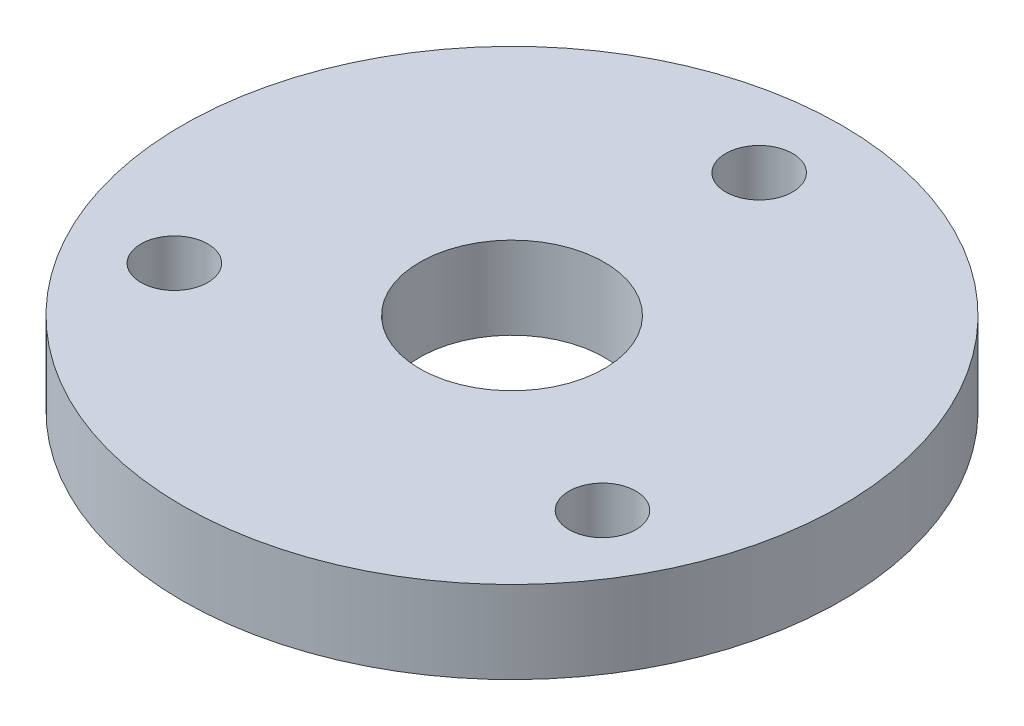
ISO-10303-21;
HEADER;
FILE_DESCRIPTION(('STEP AP214'),'2;1');
FILE_NAME('part.step','',(''),(''),'','','');
FILE_SCHEMA(('AUTOMOTIVE_DESIGN { 1 0 10303 214 1 1 1 1 }'));
ENDSEC;
DATA;
#1=APPLICATION_CONTEXT('core data for automotive mechanical design processes');
#2=APPLICATION_PROTOCOL_DEFINITION('international standard','automotive_design',2000,#1);
#3=PRODUCT_CONTEXT('',#1,'mechanical');
#4=PRODUCT('Part','Part','',(#3));
#5=PRODUCT_RELATED_PRODUCT_CATEGORY('part','',(#4));
#6=PRODUCT_DEFINITION_FORMATION('','',#4);
#7=PRODUCT_DEFINITION_CONTEXT('part definition',#1,'design');
#8=PRODUCT_DEFINITION('design','',#6,#7);
#9=PRODUCT_DEFINITION_SHAPE('','',#8);
#10=(LENGTH_UNIT() NAMED_UNIT(*) SI_UNIT(.MILLI.,.METRE.));
#11=(NAMED_UNIT(*) PLANE_ANGLE_UNIT() SI_UNIT($,.RADIAN.));
#12=(NAMED_UNIT(*) SI_UNIT($,.STERADIAN.) SOLID_ANGLE_UNIT());
#13=UNCERTAINTY_MEASURE_WITH_UNIT(LENGTH_MEASURE(1.E-05),#10,'distance_accuracy_value','');
#14=(GEOMETRIC_REPRESENTATION_CONTEXT(3) GLOBAL_UNCERTAINTY_ASSIGNED_CONTEXT((#13)) GLOBAL_UNIT_ASSIGNED_CONTEXT((#10,
#11,#12)) REPRESENTATION_CONTEXT('',''));
#15=CARTESIAN_POINT('',(0.,0.,0.));
#16=DIRECTION('',(0.,0.,1.));
#17=DIRECTION('',(1.,0.,0.));
#18=AXIS2_PLACEMENT_3D('',#15,#16,#17);
#19=CARTESIAN_POINT('',(0.,12.5,0.));
#20=DIRECTION('',(0.,1.,0.));
#21=DIRECTION('',(0.,0.,1.));
#22=AXIS2_PLACEMENT_3D('',#19,#20,#21);
#23=PLANE('',#22);
#24=CARTESIAN_POINT('',(64.9519052838316,12.5,37.4999999999968));
#25=DIRECTION('',(0.,1.,0.));
#26=DIRECTION('',(0.,0.,1.));
#27=AXIS2_PLACEMENT_3D('',#24,#25,#26);
#28=CIRCLE('',#27,10.1500000000032);
#29=CARTESIAN_POINT('',(64.9519052838316,12.5,47.65));
#30=VERTEX_POINT('',#29);
#31=EDGE_CURVE('E53',#30,#30,#28,.T.);
#32=ORIENTED_EDGE('',*,*,#31,.F.);
#33=EDGE_LOOP('',(#32));
#34=FACE_BOUND('',#33,.T.);
#35=CARTESIAN_POINT('',(0.,12.5,0.));
#36=DIRECTION('',(0.,1.,0.));
#37=DIRECTION('',(0.,0.,1.));
#38=AXIS2_PLACEMENT_3D('',#35,#36,#37);
#39=CIRCLE('',#38,28.);
#40=CARTESIAN_POINT('',(0.,12.5,28.));
#41=VERTEX_POINT('',#40);
#42=EDGE_CURVE('E42',#41,#41,#39,.T.);
#43=ORIENTED_EDGE('',*,*,#42,.F.);
#44=EDGE_LOOP('',(#43));
#45=FACE_BOUND('',#44,.T.);
#46=CARTESIAN_POINT('',(0.,12.5,0.));
#47=DIRECTION('',(0.,1.,0.));
#48=DIRECTION('',(0.,0.,1.));
#49=AXIS2_PLACEMENT_3D('',#46,#47,#48);
#50=CIRCLE('',#49,100.);
#51=CARTESIAN_POINT('',(0.,12.5,100.));
#52=VERTEX_POINT('',#51);
#53=EDGE_CURVE('E10',#52,#52,#50,.T.);
#54=ORIENTED_EDGE('',*,*,#53,.T.);
#55=EDGE_LOOP('',(#54));
#56=FACE_BOUND('',#55,.T.);
#57=CARTESIAN_POINT('',(0.,12.5,-75.));
#58=DIRECTION('',(0.,1.,0.));
#59=DIRECTION('',(0.,0.,1.));
#60=AXIS2_PLACEMENT_3D('',#57,#58,#59);
#61=CIRCLE('',#60,10.15);
#62=CARTESIAN_POINT('',(0.,12.5,-64.85));
#63=VERTEX_POINT('',#62);
#64=EDGE_CURVE('E47',#63,#63,#61,.T.);
#65=ORIENTED_EDGE('',*,*,#64,.F.);
#66=EDGE_LOOP('',(#65));
#67=FACE_BOUND('',#66,.T.);
#68=CARTESIAN_POINT('',(-64.9519052838308,12.5,37.4999999999973));
#69=DIRECTION('',(0.,1.,0.));
#70=DIRECTION('',(0.,0.,1.));
#71=AXIS2_PLACEMENT_3D('',#68,#69,#70);
#72=CIRCLE('',#71,10.1500000000004);
#73=CARTESIAN_POINT('',(-64.9519052838308,12.5,47.6499999999977));
#74=VERTEX_POINT('',#73);
#75=EDGE_CURVE('E59',#74,#74,#72,.T.);
#76=ORIENTED_EDGE('',*,*,#75,.F.);
#77=EDGE_LOOP('',(#76));
#78=FACE_BOUND('',#77,.T.);
#79=ADVANCED_FACE('F31',(#34,#45,#56,#67,#78),#23,.T.);
#80=CARTESIAN_POINT('',(0.,-12.5,0.));
#81=DIRECTION('',(0.,1.,0.));
#82=DIRECTION('',(0.,0.,1.));
#83=AXIS2_PLACEMENT_3D('',#80,#81,#82);
#84=PLANE('',#83);
#85=CARTESIAN_POINT('',(0.,-12.5,0.));
#86=DIRECTION('',(0.,1.,0.));
#87=DIRECTION('',(0.,0.,1.));
#88=AXIS2_PLACEMENT_3D('',#85,#86,#87);
#89=CIRCLE('',#88,100.);
#90=CARTESIAN_POINT('',(0.,-12.5,100.));
#91=VERTEX_POINT('',#90);
#92=EDGE_CURVE('E35',#91,#91,#89,.T.);
#93=ORIENTED_EDGE('',*,*,#92,.F.);
#94=EDGE_LOOP('',(#93));
#95=FACE_BOUND('',#94,.T.);
#96=CARTESIAN_POINT('',(0.,-12.5,0.));
#97=DIRECTION('',(0.,1.,0.));
#98=DIRECTION('',(0.,0.,1.));
#99=AXIS2_PLACEMENT_3D('',#96,#97,#98);
#100=CIRCLE('',#99,28.);
#101=CARTESIAN_POINT('',(0.,-12.5,28.));
#102=VERTEX_POINT('',#101);
#103=EDGE_CURVE('E44',#102,#102,#100,.T.);
#104=ORIENTED_EDGE('',*,*,#103,.T.);
#105=EDGE_LOOP('',(#104));
#106=FACE_BOUND('',#105,.T.);
#107=CARTESIAN_POINT('',(0.,-12.5,-75.));
#108=DIRECTION('',(0.,1.,0.));
#109=DIRECTION('',(0.,0.,1.));
#110=AXIS2_PLACEMENT_3D('',#107,#108,#109);
#111=CIRCLE('',#110,10.15);
#112=CARTESIAN_POINT('',(0.,-12.5,-64.85));
#113=VERTEX_POINT('',#112);
#114=EDGE_CURVE('E50',#113,#113,#111,.T.);
#115=ORIENTED_EDGE('',*,*,#114,.T.);
#116=EDGE_LOOP('',(#115));
#117=FACE_BOUND('',#116,.T.);
#118=CARTESIAN_POINT('',(64.9519052838316,-12.5,37.4999999999968));
#119=DIRECTION('',(0.,1.,0.));
#120=DIRECTION('',(0.,0.,1.));
#121=AXIS2_PLACEMENT_3D('',#118,#119,#120);
#122=CIRCLE('',#121,10.1500000000032);
#123=CARTESIAN_POINT('',(64.9519052838316,-12.5,47.65));
#124=VERTEX_POINT('',#123);
#125=EDGE_CURVE('E56',#124,#124,#122,.T.);
#126=ORIENTED_EDGE('',*,*,#125,.T.);
#127=EDGE_LOOP('',(#126));
#128=FACE_BOUND('',#127,.T.);
#129=CARTESIAN_POINT('',(-64.9519052838308,-12.5,37.4999999999973));
#130=DIRECTION('',(0.,1.,0.));
#131=DIRECTION('',(0.,0.,1.));
#132=AXIS2_PLACEMENT_3D('',#129,#130,#131);
#133=CIRCLE('',#132,10.1500000000004);
#134=CARTESIAN_POINT('',(-64.9519052838308,-12.5,47.6499999999977));
#135=VERTEX_POINT('',#134);
#136=EDGE_CURVE('E62',#135,#135,#133,.T.);
#137=ORIENTED_EDGE('',*,*,#136,.T.);
#138=EDGE_LOOP('',(#137));
#139=FACE_BOUND('',#138,.T.);
#140=ADVANCED_FACE('F72',(#95,#106,#117,#128,#139),#84,.F.);
#141=CARTESIAN_POINT('',(0.,12.5,0.));
#142=DIRECTION('',(0.,-1.,0.));
#143=DIRECTION('',(0.,0.,-1.));
#144=AXIS2_PLACEMENT_3D('',#141,#142,#143);
#145=CYLINDRICAL_SURFACE('',#144,100.);
#146=ORIENTED_EDGE('',*,*,#53,.F.);
#147=EDGE_LOOP('',(#146));
#148=FACE_BOUND('',#147,.T.);
#149=ORIENTED_EDGE('',*,*,#92,.T.);
#150=EDGE_LOOP('',(#149));
#151=FACE_BOUND('',#150,.T.);
#152=ADVANCED_FACE('F33',(#148,#151),#145,.T.);
#153=CARTESIAN_POINT('',(0.,12.5,0.));
#154=DIRECTION('',(0.,-1.,0.));
#155=DIRECTION('',(0.,0.,-1.));
#156=AXIS2_PLACEMENT_3D('',#153,#154,#155);
#157=CYLINDRICAL_SURFACE('',#156,28.);
#158=ORIENTED_EDGE('',*,*,#42,.T.);
#159=EDGE_LOOP('',(#158));
#160=FACE_BOUND('',#159,.T.);
#161=ORIENTED_EDGE('',*,*,#103,.F.);
#162=EDGE_LOOP('',(#161));
#163=FACE_BOUND('',#162,.T.);
#164=ADVANCED_FACE('F82',(#160,#163),#157,.F.);
#165=CARTESIAN_POINT('',(0.,12.5,-75.));
#166=DIRECTION('',(0.,-1.,0.));
#167=DIRECTION('',(0.,0.,-1.));
#168=AXIS2_PLACEMENT_3D('',#165,#166,#167);
#169=CYLINDRICAL_SURFACE('',#168,10.15);
#170=ORIENTED_EDGE('',*,*,#64,.T.);
#171=EDGE_LOOP('',(#170));
#172=FACE_BOUND('',#171,.T.);
#173=ORIENTED_EDGE('',*,*,#114,.F.);
#174=EDGE_LOOP('',(#173));
#175=FACE_BOUND('',#174,.T.);
#176=ADVANCED_FACE('F85',(#172,#175),#169,.F.);
#177=CARTESIAN_POINT('',(64.9519052838316,12.5,37.4999999999968));
#178=DIRECTION('',(0.,-1.,0.));
#179=DIRECTION('',(0.,0.,-1.));
#180=AXIS2_PLACEMENT_3D('',#177,#178,#179);
#181=CYLINDRICAL_SURFACE('',#180,10.1500000000032);
#182=ORIENTED_EDGE('',*,*,#31,.T.);
#183=EDGE_LOOP('',(#182));
#184=FACE_BOUND('',#183,.T.);
#185=ORIENTED_EDGE('',*,*,#125,.F.);
#186=EDGE_LOOP('',(#185));
#187=FACE_BOUND('',#186,.T.);
#188=ADVANCED_FACE('F89',(#184,#187),#181,.F.);
#189=CARTESIAN_POINT('',(-64.9519052838308,12.5,37.4999999999973));
#190=DIRECTION('',(0.,-1.,0.));
#191=DIRECTION('',(0.,0.,-1.));
#192=AXIS2_PLACEMENT_3D('',#189,#190,#191);
#193=CYLINDRICAL_SURFACE('',#192,10.1500000000004);
#194=ORIENTED_EDGE('',*,*,#75,.T.);
#195=EDGE_LOOP('',(#194));
#196=FACE_BOUND('',#195,.T.);
#197=ORIENTED_EDGE('',*,*,#136,.F.);
#198=EDGE_LOOP('',(#197));
#199=FACE_BOUND('',#198,.T.);
#200=ADVANCED_FACE('F68',(#196,#199),#193,.F.);
#201=CLOSED_SHELL('',(#79,#140,#152,#164,#176,#188,#200));
#202=MANIFOLD_SOLID_BREP('B2',#201);
#203=ADVANCED_BREP_SHAPE_REPRESENTATION('',(#18,#202),#14);
#204=SHAPE_DEFINITION_REPRESENTATION(#9,#203);
ENDSEC;
END-ISO-10303-21;
